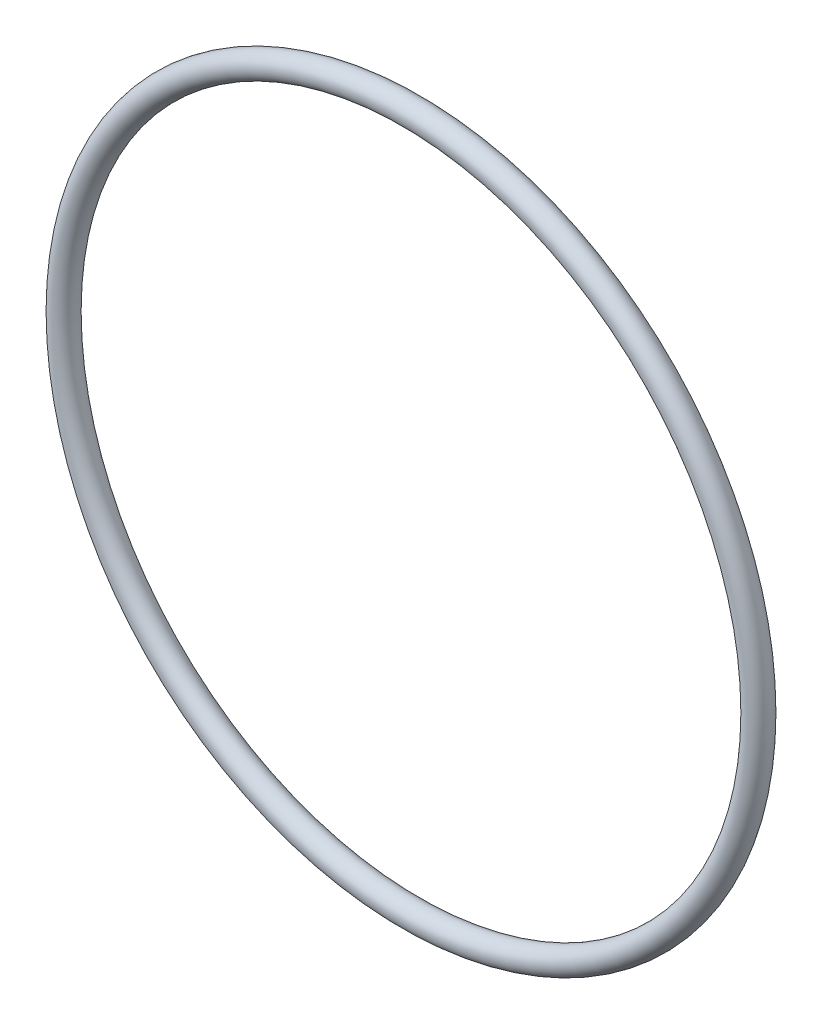
ISO-10303-21;
HEADER;
FILE_DESCRIPTION(('STEP AP214'),'2;1');
FILE_NAME('part.step','',(''),(''),'','','');
FILE_SCHEMA(('AUTOMOTIVE_DESIGN { 1 0 10303 214 1 1 1 1 }'));
ENDSEC;
DATA;
#1=APPLICATION_CONTEXT('core data for automotive mechanical design processes');
#2=APPLICATION_PROTOCOL_DEFINITION('international standard','automotive_design',2000,#1);
#3=PRODUCT_CONTEXT('',#1,'mechanical');
#4=PRODUCT('Part','Part','',(#3));
#5=PRODUCT_RELATED_PRODUCT_CATEGORY('part','',(#4));
#6=PRODUCT_DEFINITION_FORMATION('','',#4);
#7=PRODUCT_DEFINITION_CONTEXT('part definition',#1,'design');
#8=PRODUCT_DEFINITION('design','',#6,#7);
#9=PRODUCT_DEFINITION_SHAPE('','',#8);
#10=(LENGTH_UNIT() NAMED_UNIT(*) SI_UNIT(.MILLI.,.METRE.));
#11=(NAMED_UNIT(*) PLANE_ANGLE_UNIT() SI_UNIT($,.RADIAN.));
#12=(NAMED_UNIT(*) SI_UNIT($,.STERADIAN.) SOLID_ANGLE_UNIT());
#13=UNCERTAINTY_MEASURE_WITH_UNIT(LENGTH_MEASURE(1.E-05),#10,'distance_accuracy_value','');
#14=(GEOMETRIC_REPRESENTATION_CONTEXT(3) GLOBAL_UNCERTAINTY_ASSIGNED_CONTEXT((#13)) GLOBAL_UNIT_ASSIGNED_CONTEXT((#10,
#11,#12)) REPRESENTATION_CONTEXT('',''));
#15=CARTESIAN_POINT('',(0.,0.,0.));
#16=DIRECTION('',(0.,0.,1.));
#17=DIRECTION('',(1.,0.,0.));
#18=AXIS2_PLACEMENT_3D('',#15,#16,#17);
#19=CARTESIAN_POINT('',(0.,0.,0.6));
#20=DIRECTION('',(0.,0.,-1.));
#21=DIRECTION('',(-1.,0.,0.));
#22=AXIS2_PLACEMENT_3D('',#19,#20,#21);
#23=TOROIDAL_SURFACE('',#22,1.4,0.0499999999999999);
#24=CARTESIAN_POINT('',(-1.45,0.,0.6));
#25=VERTEX_POINT('',#24);
#26=VERTEX_LOOP('',#25);
#27=FACE_BOUND('',#26,.T.);
#28=ADVANCED_FACE('F13',(#27),#23,.T.);
#29=CLOSED_SHELL('',(#28));
#30=MANIFOLD_SOLID_BREP('B1',#29);
#31=ADVANCED_BREP_SHAPE_REPRESENTATION('',(#18,#30),#14);
#32=SHAPE_DEFINITION_REPRESENTATION(#9,#31);
ENDSEC;
END-ISO-10303-21;
